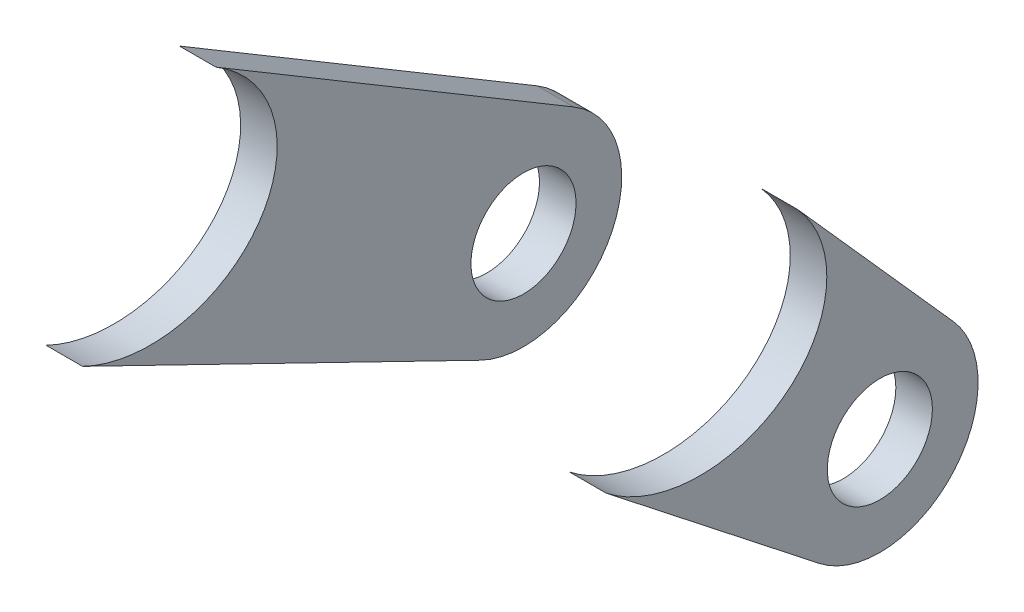
ISO-10303-21;
HEADER;
FILE_DESCRIPTION(('STEP AP214'),'2;1');
FILE_NAME('part.step','',(''),(''),'','','');
FILE_SCHEMA(('AUTOMOTIVE_DESIGN { 1 0 10303 214 1 1 1 1 }'));
ENDSEC;
DATA;
#1=APPLICATION_CONTEXT('core data for automotive mechanical design processes');
#2=APPLICATION_PROTOCOL_DEFINITION('international standard','automotive_design',2000,#1);
#3=PRODUCT_CONTEXT('',#1,'mechanical');
#4=PRODUCT('Part','Part','',(#3));
#5=PRODUCT_RELATED_PRODUCT_CATEGORY('part','',(#4));
#6=PRODUCT_DEFINITION_FORMATION('','',#4);
#7=PRODUCT_DEFINITION_CONTEXT('part definition',#1,'design');
#8=PRODUCT_DEFINITION('design','',#6,#7);
#9=PRODUCT_DEFINITION_SHAPE('','',#8);
#10=(LENGTH_UNIT() NAMED_UNIT(*) SI_UNIT(.MILLI.,.METRE.));
#11=(NAMED_UNIT(*) PLANE_ANGLE_UNIT() SI_UNIT($,.RADIAN.));
#12=(NAMED_UNIT(*) SI_UNIT($,.STERADIAN.) SOLID_ANGLE_UNIT());
#13=UNCERTAINTY_MEASURE_WITH_UNIT(LENGTH_MEASURE(1.E-05),#10,'distance_accuracy_value','');
#14=(GEOMETRIC_REPRESENTATION_CONTEXT(3) GLOBAL_UNCERTAINTY_ASSIGNED_CONTEXT((#13)) GLOBAL_UNIT_ASSIGNED_CONTEXT((#10,
#11,#12)) REPRESENTATION_CONTEXT('',''));
#15=CARTESIAN_POINT('',(0.,0.,0.));
#16=DIRECTION('',(0.,0.,1.));
#17=DIRECTION('',(1.,0.,0.));
#18=AXIS2_PLACEMENT_3D('',#15,#16,#17);
#19=CARTESIAN_POINT('',(-32.685367890936,36.9896296930034,-22.0590699883855));
#20=DIRECTION('',(8.81129300600473E-09,-0.85886974750775,0.51219406167582));
#21=DIRECTION('',(0.,0.51219406167582,0.85886974750775));
#22=AXIS2_PLACEMENT_3D('',#19,#20,#21);
#23=PLANE('',#22);
#24=DIRECTION('',(2.451138004461E-08,0.51219406167582,0.85886974750775));
#25=VECTOR('',#24,1.);
#26=CARTESIAN_POINT('',(-28.685367890936,36.9896296730561,-22.0590700906462));
#27=LINE('',#26,#25);
#28=CARTESIAN_POINT('',(-28.6853820716599,-259.333244181995,-518.946423715882));
#29=VERTEX_POINT('',#28);
#30=CARTESIAN_POINT('',(-28.6853809539655,-235.977708006868,-479.782823513239));
#31=VERTEX_POINT('',#30);
#32=EDGE_CURVE('E129',#29,#31,#27,.T.);
#33=ORIENTED_EDGE('',*,*,#32,.F.);
#34=DIRECTION('',(1.,-4.98683030140527E-09,-2.55651747405935E-08));
#35=VECTOR('',#34,1.);
#36=CARTESIAN_POINT('',(-32.6853820716599,-259.333244162048,-518.946423613621));
#37=LINE('',#36,#35);
#38=CARTESIAN_POINT('',(-32.6853820716599,-259.333244162048,-518.946423613621));
#39=VERTEX_POINT('',#38);
#40=EDGE_CURVE('E130',#39,#29,#37,.T.);
#41=ORIENTED_EDGE('',*,*,#40,.F.);
#42=DIRECTION('',(2.451138004461E-08,0.51219406167582,0.85886974750775));
#43=VECTOR('',#42,1.);
#44=CARTESIAN_POINT('',(-32.685367890936,36.9896296930034,-22.0590699883855));
#45=LINE('',#44,#43);
#46=CARTESIAN_POINT('',(-32.6853809539655,-235.977707986921,-479.782823410978));
#47=VERTEX_POINT('',#46);
#48=EDGE_CURVE('E107',#39,#47,#45,.T.);
#49=ORIENTED_EDGE('',*,*,#48,.T.);
#50=DIRECTION('',(1.,-4.98683030140527E-09,-2.55651747405935E-08));
#51=VECTOR('',#50,1.);
#52=CARTESIAN_POINT('',(-32.6853809539655,-235.977707986921,-479.782823410978));
#53=LINE('',#52,#51);
#54=EDGE_CURVE('E12',#47,#31,#53,.T.);
#55=ORIENTED_EDGE('',*,*,#54,.T.);
#56=EDGE_LOOP('',(#33,#41,#49,#55));
#57=FACE_BOUND('',#56,.T.);
#58=ADVANCED_FACE('F49',(#57),#23,.F.);
#59=CARTESIAN_POINT('',(-32.6853804211867,-243.82454050635,-457.412173364182));
#60=CARTESIAN_POINT('',(-32.6853804009217,-219.149935523307,-461.432604800083));
#61=CARTESIAN_POINT('',(-32.6853811640998,-223.864169323152,-490.365284952312));
#62=CARTESIAN_POINT('',(-32.6853811843649,-248.538774306195,-486.34485351641));
#63=CARTESIAN_POINT('',(-32.6853812046299,-273.213379289238,-482.324422080509));
#64=CARTESIAN_POINT('',(-32.6853804414518,-268.499145489393,-453.391741928281));
#65=CARTESIAN_POINT('',(-32.6853804211867,-243.82454050635,-457.412173364182));
#66=(BOUNDED_CURVE() B_SPLINE_CURVE(3,(#59,#60,#61,#62,#63,#64,#65),.UNSPECIFIED.,.T.,
.F.) B_SPLINE_CURVE_WITH_KNOTS((4,3,4),(0.,0.5,1.),
.UNSPECIFIED.) CURVE() GEOMETRIC_REPRESENTATION_ITEM() RATIONAL_B_SPLINE_CURVE((1.,
0.333333333333333,0.333333333333333,1.,0.333333333333333,0.333333333333333,1.)) REPRESENTATION_ITEM(''));
#67=DIRECTION('',(1.,-4.98683030140527E-09,-2.55651747405935E-08));
#68=VECTOR('',#67,1.);
#69=SURFACE_OF_LINEAR_EXTRUSION('',#66,#68);
#70=CARTESIAN_POINT('',(-28.6853804211867,-243.824540526297,-457.412173466443));
#71=CARTESIAN_POINT('',(-28.6853804009217,-219.149935543254,-461.432604902344));
#72=CARTESIAN_POINT('',(-28.6853811640998,-223.864169343099,-490.365285054572));
#73=CARTESIAN_POINT('',(-28.6853811843649,-248.538774326142,-486.344853618671));
#74=CARTESIAN_POINT('',(-28.6853812046299,-273.213379309186,-482.32442218277));
#75=CARTESIAN_POINT('',(-28.6853804414518,-268.49914550934,-453.391742030542));
#76=CARTESIAN_POINT('',(-28.6853804211867,-243.824540526297,-457.412173466443));
#77=(BOUNDED_CURVE() B_SPLINE_CURVE(3,(#70,#71,#72,#73,#74,#75,#76),.UNSPECIFIED.,.T.,
.F.) B_SPLINE_CURVE_WITH_KNOTS((4,3,4),(0.,0.5,1.),
.UNSPECIFIED.) CURVE() GEOMETRIC_REPRESENTATION_ITEM() RATIONAL_B_SPLINE_CURVE((1.,
0.333333333333333,0.333333333333333,1.,0.333333333333333,0.333333333333333,1.)) REPRESENTATION_ITEM(''));
#78=CARTESIAN_POINT('',(-28.685380685745,-257.038339252239,-465.183030214717));
#79=VERTEX_POINT('',#78);
#80=EDGE_CURVE('E131',#31,#79,#77,.T.);
#81=ORIENTED_EDGE('',*,*,#80,.F.);
#82=ORIENTED_EDGE('',*,*,#54,.F.);
#83=CARTESIAN_POINT('',(-32.685380685745,-257.038339232291,-465.183030112456));
#84=VERTEX_POINT('',#83);
#85=EDGE_CURVE('E91',#47,#84,#66,.T.);
#86=ORIENTED_EDGE('',*,*,#85,.T.);
#87=DIRECTION('',(1.,-4.98683030140527E-09,-2.55651747405935E-08));
#88=VECTOR('',#87,1.);
#89=CARTESIAN_POINT('',(-32.685380685745,-257.038339232291,-465.183030112456));
#90=LINE('',#89,#88);
#91=EDGE_CURVE('E58',#84,#79,#90,.T.);
#92=ORIENTED_EDGE('',*,*,#91,.T.);
#93=EDGE_LOOP('',(#81,#82,#86,#92));
#94=FACE_BOUND('',#93,.T.);
#95=ADVANCED_FACE('F105',(#94),#69,.T.);
#96=CARTESIAN_POINT('',(-32.6853673266121,-24.7985220412367,12.0674670765865));
#97=DIRECTION('',(6.70227974192378E-09,-0.899187722607375,0.437563069182219));
#98=DIRECTION('',(0.,0.437563069182219,0.899187722607375));
#99=AXIS2_PLACEMENT_3D('',#96,#97,#98);
#100=PLANE('',#99);
#101=DIRECTION('',(2.51699440269127E-08,0.437563069182219,0.899187722607374));
#102=VECTOR('',#101,1.);
#103=CARTESIAN_POINT('',(-28.6853673266121,-24.798522061184,12.0674669743258));
#104=LINE('',#103,#102);
#105=CARTESIAN_POINT('',(-28.685381904889,-278.232361985705,-508.736534559158));
#106=VERTEX_POINT('',#105);
#107=EDGE_CURVE('E101',#106,#79,#104,.T.);
#108=ORIENTED_EDGE('',*,*,#107,.T.);
#109=ORIENTED_EDGE('',*,*,#91,.F.);
#110=DIRECTION('',(2.51699440269127E-08,0.437563069182219,0.899187722607374));
#111=VECTOR('',#110,1.);
#112=CARTESIAN_POINT('',(-32.6853673266121,-24.7985220412367,12.0674670765865));
#113=LINE('',#112,#111);
#114=CARTESIAN_POINT('',(-32.685381904889,-278.232361965758,-508.736534456897));
#115=VERTEX_POINT('',#114);
#116=EDGE_CURVE('E94',#115,#84,#113,.T.);
#117=ORIENTED_EDGE('',*,*,#116,.F.);
#118=DIRECTION('',(1.,-4.98683030140527E-09,-2.55651747405935E-08));
#119=VECTOR('',#118,1.);
#120=CARTESIAN_POINT('',(-32.685381904889,-278.232361965758,-508.736534456897));
#121=LINE('',#120,#119);
#122=EDGE_CURVE('E104',#115,#106,#121,.T.);
#123=ORIENTED_EDGE('',*,*,#122,.T.);
#124=EDGE_LOOP('',(#108,#109,#117,#123));
#125=FACE_BOUND('',#124,.T.);
#126=ADVANCED_FACE('F100',(#125),#100,.T.);
#127=CARTESIAN_POINT('',(-32.6853819769385,-268.566093947604,-513.44033745035));
#128=DIRECTION('',(1.,-4.98683030140527E-09,-2.55651747405935E-08));
#129=DIRECTION('',(2.55651747405935E-08,0.,1.));
#130=AXIS2_PLACEMENT_3D('',#127,#128,#129);
#131=CYLINDRICAL_SURFACE('',#130,5.75000000000009);
#132=CARTESIAN_POINT('',(-32.6853819769385,-268.566093947604,-513.44033745035));
#133=DIRECTION('',(1.,-4.98683031828182E-09,-2.5565174734255E-08));
#134=DIRECTION('',(-2.5565174734255E-08,0.,-1.));
#135=AXIS2_PLACEMENT_3D('',#132,#133,#134);
#136=CIRCLE('',#135,5.75000000000009);
#137=CARTESIAN_POINT('',(-32.6853821239382,-268.566093947604,-519.19033745035));
#138=VERTEX_POINT('',#137);
#139=EDGE_CURVE('E109',#138,#138,#136,.T.);
#140=ORIENTED_EDGE('',*,*,#139,.F.);
#141=EDGE_LOOP('',(#140));
#142=FACE_BOUND('',#141,.T.);
#143=CARTESIAN_POINT('',(-28.6853819769385,-268.566093967551,-513.440337552611));
#144=DIRECTION('',(1.,-4.98683031828182E-09,-2.5565174734255E-08));
#145=DIRECTION('',(-2.5565174734255E-08,0.,-1.));
#146=AXIS2_PLACEMENT_3D('',#143,#144,#145);
#147=CIRCLE('',#146,5.75000000000009);
#148=CARTESIAN_POINT('',(-28.6853821239382,-268.566093967551,-519.190337552611));
#149=VERTEX_POINT('',#148);
#150=EDGE_CURVE('E132',#149,#149,#147,.T.);
#151=ORIENTED_EDGE('',*,*,#150,.T.);
#152=EDGE_LOOP('',(#151));
#153=FACE_BOUND('',#152,.T.);
#154=ADVANCED_FACE('F51',(#142,#153),#131,.F.);
#155=CARTESIAN_POINT('',(-32.6853819769385,-268.566093947604,-513.44033745035));
#156=DIRECTION('',(1.,-4.98683030140527E-09,-2.55651747405935E-08));
#157=DIRECTION('',(2.55651747405935E-08,0.,1.));
#158=AXIS2_PLACEMENT_3D('',#155,#156,#157);
#159=CYLINDRICAL_SURFACE('',#158,10.7500000000001);
#160=CARTESIAN_POINT('',(-28.6853819769385,-268.566093967551,-513.440337552611));
#161=DIRECTION('',(1.,-4.98683031828182E-09,-2.5565174734255E-08));
#162=DIRECTION('',(-2.5565174734255E-08,0.,-1.));
#163=AXIS2_PLACEMENT_3D('',#160,#161,#162);
#164=CIRCLE('',#163,10.7500000000001);
#165=EDGE_CURVE('E80',#106,#29,#164,.T.);
#166=ORIENTED_EDGE('',*,*,#165,.F.);
#167=ORIENTED_EDGE('',*,*,#122,.F.);
#168=CARTESIAN_POINT('',(-32.6853819769385,-268.566093947604,-513.44033745035));
#169=DIRECTION('',(1.,-4.98683031828182E-09,-2.5565174734255E-08));
#170=DIRECTION('',(-2.5565174734255E-08,0.,-1.));
#171=AXIS2_PLACEMENT_3D('',#168,#169,#170);
#172=CIRCLE('',#171,10.7500000000001);
#173=EDGE_CURVE('E66',#115,#39,#172,.T.);
#174=ORIENTED_EDGE('',*,*,#173,.T.);
#175=ORIENTED_EDGE('',*,*,#40,.T.);
#176=EDGE_LOOP('',(#166,#167,#174,#175));
#177=FACE_BOUND('',#176,.T.);
#178=ADVANCED_FACE('F153',(#177),#159,.T.);
#179=CARTESIAN_POINT('',(-32.685367511453,1.62996381602791E-07,8.35607131708992E-07));
#180=DIRECTION('',(-1.,4.98683031828182E-09,2.5565174734255E-08));
#181=DIRECTION('',(-2.5565174734255E-08,0.,-1.));
#182=AXIS2_PLACEMENT_3D('',#179,#180,#181);
#183=PLANE('',#182);
#184=ORIENTED_EDGE('',*,*,#139,.T.);
#185=EDGE_LOOP('',(#184));
#186=FACE_BOUND('',#185,.T.);
#187=ORIENTED_EDGE('',*,*,#48,.F.);
#188=ORIENTED_EDGE('',*,*,#173,.F.);
#189=ORIENTED_EDGE('',*,*,#116,.T.);
#190=ORIENTED_EDGE('',*,*,#85,.F.);
#191=EDGE_LOOP('',(#187,#188,#189,#190));
#192=FACE_BOUND('',#191,.T.);
#193=ADVANCED_FACE('F96',(#186,#192),#183,.T.);
#194=CARTESIAN_POINT('',(-28.685367511453,1.4304906039717E-07,7.33346432746618E-07));
#195=DIRECTION('',(-1.,4.98683031828182E-09,2.5565174734255E-08));
#196=DIRECTION('',(-2.5565174734255E-08,0.,-1.));
#197=AXIS2_PLACEMENT_3D('',#194,#195,#196);
#198=PLANE('',#197);
#199=ORIENTED_EDGE('',*,*,#150,.F.);
#200=EDGE_LOOP('',(#199));
#201=FACE_BOUND('',#200,.T.);
#202=ORIENTED_EDGE('',*,*,#32,.T.);
#203=ORIENTED_EDGE('',*,*,#80,.T.);
#204=ORIENTED_EDGE('',*,*,#107,.F.);
#205=ORIENTED_EDGE('',*,*,#165,.T.);
#206=EDGE_LOOP('',(#202,#203,#204,#205));
#207=FACE_BOUND('',#206,.T.);
#208=ADVANCED_FACE('F146',(#201,#207),#198,.F.);
#209=CLOSED_SHELL('',(#58,#95,#126,#154,#178,#193,#208));
#210=MANIFOLD_SOLID_BREP('B2',#209);
#211=CARTESIAN_POINT('',(10.3146290873709,143.374441874379,-161.006531885884));
#212=DIRECTION('',(-1.57760826096266E-08,0.665030851347808,-0.746815885446747));
#213=DIRECTION('',(0.,-0.746815885446747,-0.665030851347808));
#214=AXIS2_PLACEMENT_3D('',#211,#212,#213);
#215=PLANE('',#214);
#216=DIRECTION('',(2.07258740079389E-08,0.746815885446748,0.665030851347808));
#217=VECTOR('',#216,1.);
#218=CARTESIAN_POINT('',(6.31462908737091,143.374441894326,-161.006531783623));
#219=LINE('',#218,#217);
#220=CARTESIAN_POINT('',(6.31461785346862,-261.417012490151,-521.468609215989));
#221=VERTEX_POINT('',#220);
#222=CARTESIAN_POINT('',(6.31461838357811,-242.315565556028,-504.458993105619));
#223=VERTEX_POINT('',#222);
#224=EDGE_CURVE('E276',#221,#223,#219,.T.);
#225=ORIENTED_EDGE('',*,*,#224,.T.);
#226=DIRECTION('',(-1.,4.98683030140527E-09,2.55651747405935E-08));
#227=VECTOR('',#226,1.);
#228=CARTESIAN_POINT('',(10.3146183835781,-242.315565575976,-504.45899320788));
#229=LINE('',#228,#227);
#230=CARTESIAN_POINT('',(10.3146183835781,-242.315565575976,-504.45899320788));
#231=VERTEX_POINT('',#230);
#232=EDGE_CURVE('E209',#231,#223,#229,.T.);
#233=ORIENTED_EDGE('',*,*,#232,.F.);
#234=DIRECTION('',(2.07258740079389E-08,0.746815885446748,0.665030851347808));
#235=VECTOR('',#234,1.);
#236=CARTESIAN_POINT('',(10.3146290873709,143.374441874379,-161.006531885884));
#237=LINE('',#236,#235);
#238=CARTESIAN_POINT('',(10.3146178534686,-261.417012510098,-521.468609318249));
#239=VERTEX_POINT('',#238);
#240=EDGE_CURVE('E259',#239,#231,#237,.T.);
#241=ORIENTED_EDGE('',*,*,#240,.F.);
#242=DIRECTION('',(-1.,4.98683030140527E-09,2.55651747405935E-08));
#243=VECTOR('',#242,1.);
#244=CARTESIAN_POINT('',(10.3146178534686,-261.417012510098,-521.468609318249));
#245=LINE('',#244,#243);
#246=EDGE_CURVE('E47',#239,#221,#245,.T.);
#247=ORIENTED_EDGE('',*,*,#246,.T.);
#248=EDGE_LOOP('',(#225,#233,#241,#247));
#249=FACE_BOUND('',#248,.T.);
#250=ADVANCED_FACE('F205',(#249),#215,.T.);
#251=CARTESIAN_POINT('',(10.3146180230615,-268.566094162037,-513.440338549652));
#252=DIRECTION('',(-1.,4.98683030140527E-09,2.55651747405935E-08));
#253=DIRECTION('',(-2.55651747405935E-08,0.,-1.));
#254=AXIS2_PLACEMENT_3D('',#251,#252,#253);
#255=CYLINDRICAL_SURFACE('',#254,10.7499999999999);
#256=CARTESIAN_POINT('',(6.31461802306151,-268.56609414209,-513.440338447392));
#257=DIRECTION('',(1.,-4.98683030433046E-09,-2.55651747346469E-08));
#258=DIRECTION('',(-2.55651747346469E-08,0.,-1.));
#259=AXIS2_PLACEMENT_3D('',#256,#257,#258);
#260=CIRCLE('',#259,10.7499999999999);
#261=CARTESIAN_POINT('',(6.31461815066465,-277.019995954462,-506.800003806218));
#262=VERTEX_POINT('',#261);
#263=EDGE_CURVE('E247',#262,#221,#260,.T.);
#264=ORIENTED_EDGE('',*,*,#263,.T.);
#265=ORIENTED_EDGE('',*,*,#246,.F.);
#266=CARTESIAN_POINT('',(10.3146180230615,-268.566094162037,-513.440338549652));
#267=DIRECTION('',(1.,-4.98683030433046E-09,-2.55651747346469E-08));
#268=DIRECTION('',(-2.55651747346469E-08,0.,-1.));
#269=AXIS2_PLACEMENT_3D('',#266,#267,#268);
#270=CIRCLE('',#269,10.7499999999999);
#271=CARTESIAN_POINT('',(10.3146181506647,-277.019995974409,-506.800003908478));
#272=VERTEX_POINT('',#271);
#273=EDGE_CURVE('E224',#272,#239,#270,.T.);
#274=ORIENTED_EDGE('',*,*,#273,.F.);
#275=DIRECTION('',(-1.,4.98683030140527E-09,2.55651747405935E-08));
#276=VECTOR('',#275,1.);
#277=CARTESIAN_POINT('',(10.3146181506647,-277.019995974409,-506.800003908478));
#278=LINE('',#277,#276);
#279=EDGE_CURVE('E215',#272,#262,#278,.T.);
#280=ORIENTED_EDGE('',*,*,#279,.T.);
#281=EDGE_LOOP('',(#264,#265,#274,#280));
#282=FACE_BOUND('',#281,.T.);
#283=ADVANCED_FACE('F288',(#282),#255,.T.);
#284=CARTESIAN_POINT('',(10.3146313584933,74.867774510086,-58.8068196464193));
#285=DIRECTION('',(-1.18700596950814E-08,0.786409470899636,-0.617705548039965));
#286=DIRECTION('',(0.,-0.617705548039965,-0.786409470899636));
#287=AXIS2_PLACEMENT_3D('',#284,#285,#286);
#288=PLANE('',#287);
#289=DIRECTION('',(2.31850882826492E-08,0.617705548039965,0.786409470899636));
#290=VECTOR('',#289,1.);
#291=CARTESIAN_POINT('',(6.31463135849329,74.8677745300334,-58.8068195441586));
#292=LINE('',#291,#290);
#293=CARTESIAN_POINT('',(6.31461883810034,-258.705084692557,-483.483037136984));
#294=VERTEX_POINT('',#293);
#295=EDGE_CURVE('E241',#262,#294,#292,.T.);
#296=ORIENTED_EDGE('',*,*,#295,.F.);
#297=ORIENTED_EDGE('',*,*,#279,.F.);
#298=DIRECTION('',(2.31850882826492E-08,0.617705548039965,0.786409470899636));
#299=VECTOR('',#298,1.);
#300=CARTESIAN_POINT('',(10.3146313584933,74.867774510086,-58.8068196464193));
#301=LINE('',#300,#299);
#302=CARTESIAN_POINT('',(10.3146188381003,-258.705084712504,-483.483037239244));
#303=VERTEX_POINT('',#302);
#304=EDGE_CURVE('E257',#272,#303,#301,.T.);
#305=ORIENTED_EDGE('',*,*,#304,.T.);
#306=DIRECTION('',(-1.,4.98683030140527E-09,2.55651747405935E-08));
#307=VECTOR('',#306,1.);
#308=CARTESIAN_POINT('',(10.3146188381003,-258.705084712504,-483.483037239244));
#309=LINE('',#308,#307);
#310=EDGE_CURVE('E262',#303,#294,#309,.T.);
#311=ORIENTED_EDGE('',*,*,#310,.T.);
#312=EDGE_LOOP('',(#296,#297,#305,#311));
#313=FACE_BOUND('',#312,.T.);
#314=ADVANCED_FACE('F265',(#313),#288,.F.);
#315=CARTESIAN_POINT('',(10.3146180230615,-268.566094162037,-513.440338549652));
#316=DIRECTION('',(-1.,4.98683030140527E-09,2.55651747405935E-08));
#317=DIRECTION('',(-2.55651747405935E-08,0.,-1.));
#318=AXIS2_PLACEMENT_3D('',#315,#316,#317);
#319=CYLINDRICAL_SURFACE('',#318,5.75000000000009);
#320=CARTESIAN_POINT('',(10.3146180230615,-268.566094162037,-513.440338549652));
#321=DIRECTION('',(1.,-4.98683030433046E-09,-2.55651747346469E-08));
#322=DIRECTION('',(-2.55651747346469E-08,0.,-1.));
#323=AXIS2_PLACEMENT_3D('',#320,#321,#322);
#324=CIRCLE('',#323,5.75000000000009);
#325=CARTESIAN_POINT('',(10.3146178760618,-268.566094162037,-519.190338549652));
#326=VERTEX_POINT('',#325);
#327=EDGE_CURVE('E286',#326,#326,#324,.T.);
#328=ORIENTED_EDGE('',*,*,#327,.T.);
#329=EDGE_LOOP('',(#328));
#330=FACE_BOUND('',#329,.T.);
#331=CARTESIAN_POINT('',(6.31461802306151,-268.56609414209,-513.440338447392));
#332=DIRECTION('',(1.,-4.98683030433046E-09,-2.55651747346469E-08));
#333=DIRECTION('',(-2.55651747346469E-08,0.,-1.));
#334=AXIS2_PLACEMENT_3D('',#331,#332,#333);
#335=CIRCLE('',#334,5.75000000000009);
#336=CARTESIAN_POINT('',(6.31461787606176,-268.56609414209,-519.190338447392));
#337=VERTEX_POINT('',#336);
#338=EDGE_CURVE('E273',#337,#337,#335,.T.);
#339=ORIENTED_EDGE('',*,*,#338,.F.);
#340=EDGE_LOOP('',(#339));
#341=FACE_BOUND('',#340,.T.);
#342=ADVANCED_FACE('F207',(#330,#341),#319,.F.);
#343=CARTESIAN_POINT('',(10.3146190208779,-247.270967496749,-478.563939057839));
#344=CARTESIAN_POINT('',(10.314619041143,-222.596362513706,-482.58437049374));
#345=CARTESIAN_POINT('',(10.3146182779649,-227.310596313551,-511.517050645969));
#346=CARTESIAN_POINT('',(10.3146182576998,-251.985201296594,-507.496619210067));
#347=CARTESIAN_POINT('',(10.3146182374348,-276.659806279637,-503.476187774166));
#348=CARTESIAN_POINT('',(10.3146190006129,-271.945572479792,-474.543507621938));
#349=CARTESIAN_POINT('',(10.3146190208779,-247.270967496749,-478.563939057839));
#350=(BOUNDED_CURVE() B_SPLINE_CURVE(3,(#343,#344,#345,#346,#347,#348,#349),.UNSPECIFIED.,.T.,
.F.) B_SPLINE_CURVE_WITH_KNOTS((4,3,4),(0.,0.5,1.),
.UNSPECIFIED.) CURVE() GEOMETRIC_REPRESENTATION_ITEM() RATIONAL_B_SPLINE_CURVE((1.,
0.333333333333333,0.333333333333333,1.,0.333333333333333,0.333333333333333,1.)) REPRESENTATION_ITEM(''));
#351=DIRECTION('',(-1.,4.98683030140527E-09,2.55651747405935E-08));
#352=VECTOR('',#351,1.);
#353=SURFACE_OF_LINEAR_EXTRUSION('',#350,#352);
#354=CARTESIAN_POINT('',(6.31461902087794,-247.270967476802,-478.563938955578));
#355=CARTESIAN_POINT('',(6.31461904114297,-222.596362493758,-482.58437039148));
#356=CARTESIAN_POINT('',(6.31461827796487,-227.310596293604,-511.517050543708));
#357=CARTESIAN_POINT('',(6.31461825769983,-251.985201276647,-507.496619107807));
#358=CARTESIAN_POINT('',(6.3146182374348,-276.65980625969,-503.476187671906));
#359=CARTESIAN_POINT('',(6.3146190006129,-271.945572459845,-474.543507519677));
#360=CARTESIAN_POINT('',(6.31461902087794,-247.270967476802,-478.563938955578));
#361=(BOUNDED_CURVE() B_SPLINE_CURVE(3,(#354,#355,#356,#357,#358,#359,#360),.UNSPECIFIED.,.T.,
.F.) B_SPLINE_CURVE_WITH_KNOTS((4,3,4),(0.,0.5,1.),
.UNSPECIFIED.) CURVE() GEOMETRIC_REPRESENTATION_ITEM() RATIONAL_B_SPLINE_CURVE((1.,
0.333333333333333,0.333333333333333,1.,0.333333333333333,0.333333333333333,1.)) REPRESENTATION_ITEM(''));
#362=EDGE_CURVE('E264',#223,#294,#361,.T.);
#363=ORIENTED_EDGE('',*,*,#362,.T.);
#364=ORIENTED_EDGE('',*,*,#310,.F.);
#365=EDGE_CURVE('E254',#231,#303,#350,.T.);
#366=ORIENTED_EDGE('',*,*,#365,.F.);
#367=ORIENTED_EDGE('',*,*,#232,.T.);
#368=EDGE_LOOP('',(#363,#364,#366,#367));
#369=FACE_BOUND('',#368,.T.);
#370=ADVANCED_FACE('F263',(#369),#353,.F.);
#371=CARTESIAN_POINT('',(10.314632488547,-5.1437321860217E-08,-2.63695381917157E-07));
#372=DIRECTION('',(-1.,4.98683030433046E-09,2.55651747346469E-08));
#373=DIRECTION('',(-2.55651747346469E-08,0.,-1.));
#374=AXIS2_PLACEMENT_3D('',#371,#372,#373);
#375=PLANE('',#374);
#376=ORIENTED_EDGE('',*,*,#327,.F.);
#377=EDGE_LOOP('',(#376));
#378=FACE_BOUND('',#377,.T.);
#379=ORIENTED_EDGE('',*,*,#240,.T.);
#380=ORIENTED_EDGE('',*,*,#365,.T.);
#381=ORIENTED_EDGE('',*,*,#304,.F.);
#382=ORIENTED_EDGE('',*,*,#273,.T.);
#383=EDGE_LOOP('',(#379,#380,#381,#382));
#384=FACE_BOUND('',#383,.T.);
#385=ADVANCED_FACE('F255',(#378,#384),#375,.F.);
#386=CARTESIAN_POINT('',(6.31463248854701,-3.14900006545959E-08,-1.61434682954783E-07));
#387=DIRECTION('',(-1.,4.98683030433046E-09,2.55651747346469E-08));
#388=DIRECTION('',(-2.55651747346469E-08,0.,-1.));
#389=AXIS2_PLACEMENT_3D('',#386,#387,#388);
#390=PLANE('',#389);
#391=ORIENTED_EDGE('',*,*,#338,.T.);
#392=EDGE_LOOP('',(#391));
#393=FACE_BOUND('',#392,.T.);
#394=ORIENTED_EDGE('',*,*,#224,.F.);
#395=ORIENTED_EDGE('',*,*,#263,.F.);
#396=ORIENTED_EDGE('',*,*,#295,.T.);
#397=ORIENTED_EDGE('',*,*,#362,.F.);
#398=EDGE_LOOP('',(#394,#395,#396,#397));
#399=FACE_BOUND('',#398,.T.);
#400=ADVANCED_FACE('F291',(#393,#399),#390,.T.);
#401=CLOSED_SHELL('',(#250,#283,#314,#342,#370,#385,#400));
#402=MANIFOLD_SOLID_BREP('B6',#401);
#403=ADVANCED_BREP_SHAPE_REPRESENTATION('',(#18,#210,#402),#14);
#404=SHAPE_DEFINITION_REPRESENTATION(#9,#403);
ENDSEC;
END-ISO-10303-21;
